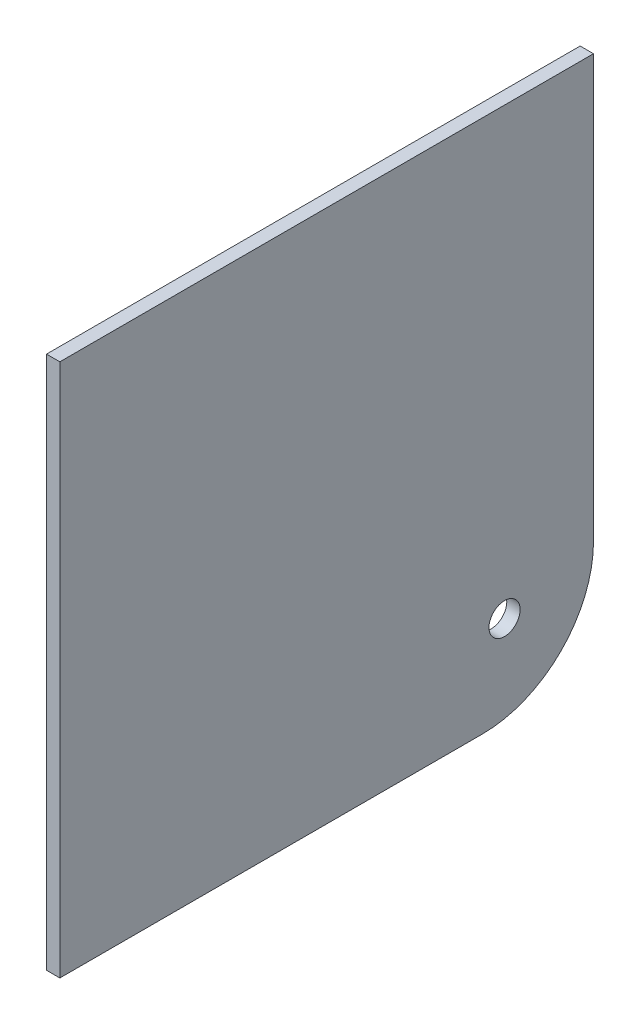
ISO-10303-21;
HEADER;
FILE_DESCRIPTION(('STEP AP214'),'2;1');
FILE_NAME('part.step','',(''),(''),'','','');
FILE_SCHEMA(('AUTOMOTIVE_DESIGN { 1 0 10303 214 1 1 1 1 }'));
ENDSEC;
DATA;
#1=APPLICATION_CONTEXT('core data for automotive mechanical design processes');
#2=APPLICATION_PROTOCOL_DEFINITION('international standard','automotive_design',2000,#1);
#3=PRODUCT_CONTEXT('',#1,'mechanical');
#4=PRODUCT('Part','Part','',(#3));
#5=PRODUCT_RELATED_PRODUCT_CATEGORY('part','',(#4));
#6=PRODUCT_DEFINITION_FORMATION('','',#4);
#7=PRODUCT_DEFINITION_CONTEXT('part definition',#1,'design');
#8=PRODUCT_DEFINITION('design','',#6,#7);
#9=PRODUCT_DEFINITION_SHAPE('','',#8);
#10=(LENGTH_UNIT() NAMED_UNIT(*) SI_UNIT(.MILLI.,.METRE.));
#11=(NAMED_UNIT(*) PLANE_ANGLE_UNIT() SI_UNIT($,.RADIAN.));
#12=(NAMED_UNIT(*) SI_UNIT($,.STERADIAN.) SOLID_ANGLE_UNIT());
#13=UNCERTAINTY_MEASURE_WITH_UNIT(LENGTH_MEASURE(1.E-05),#10,'distance_accuracy_value','');
#14=(GEOMETRIC_REPRESENTATION_CONTEXT(3) GLOBAL_UNCERTAINTY_ASSIGNED_CONTEXT((#13)) GLOBAL_UNIT_ASSIGNED_CONTEXT((#10,
#11,#12)) REPRESENTATION_CONTEXT('',''));
#15=CARTESIAN_POINT('',(0.,0.,0.));
#16=DIRECTION('',(0.,0.,1.));
#17=DIRECTION('',(1.,0.,0.));
#18=AXIS2_PLACEMENT_3D('',#15,#16,#17);
#19=CARTESIAN_POINT('',(3.,-35.,-35.));
#20=DIRECTION('',(-1.,0.,0.));
#21=DIRECTION('',(0.,0.,1.));
#22=AXIS2_PLACEMENT_3D('',#19,#20,#21);
#23=PLANE('',#22);
#24=DIRECTION('',(0.,0.,-1.));
#25=VECTOR('',#24,1.);
#26=CARTESIAN_POINT('',(3.,-60.,-35.));
#27=LINE('',#26,#25);
#28=CARTESIAN_POINT('',(3.,-60.,60.));
#29=VERTEX_POINT('',#28);
#30=CARTESIAN_POINT('',(3.,-60.,-35.));
#31=VERTEX_POINT('',#30);
#32=EDGE_CURVE('E118',#29,#31,#27,.T.);
#33=ORIENTED_EDGE('',*,*,#32,.T.);
#34=CARTESIAN_POINT('',(3.,-35.,-35.));
#35=DIRECTION('',(1.,0.,0.));
#36=DIRECTION('',(0.,0.,1.));
#37=AXIS2_PLACEMENT_3D('',#34,#35,#36);
#38=CIRCLE('',#37,25.);
#39=CARTESIAN_POINT('',(3.,-35.,-60.));
#40=VERTEX_POINT('',#39);
#41=EDGE_CURVE('E85',#31,#40,#38,.T.);
#42=ORIENTED_EDGE('',*,*,#41,.T.);
#43=DIRECTION('',(0.,1.,0.));
#44=VECTOR('',#43,1.);
#45=CARTESIAN_POINT('',(3.,60.,-60.));
#46=LINE('',#45,#44);
#47=CARTESIAN_POINT('',(3.,60.,-60.));
#48=VERTEX_POINT('',#47);
#49=EDGE_CURVE('E89',#40,#48,#46,.T.);
#50=ORIENTED_EDGE('',*,*,#49,.T.);
#51=DIRECTION('',(0.,0.,1.));
#52=VECTOR('',#51,1.);
#53=CARTESIAN_POINT('',(3.,60.,-60.));
#54=LINE('',#53,#52);
#55=CARTESIAN_POINT('',(3.,60.,60.));
#56=VERTEX_POINT('',#55);
#57=EDGE_CURVE('E93',#48,#56,#54,.T.);
#58=ORIENTED_EDGE('',*,*,#57,.T.);
#59=DIRECTION('',(0.,-1.,0.));
#60=VECTOR('',#59,1.);
#61=CARTESIAN_POINT('',(3.,60.,60.));
#62=LINE('',#61,#60);
#63=EDGE_CURVE('E51',#56,#29,#62,.T.);
#64=ORIENTED_EDGE('',*,*,#63,.T.);
#65=EDGE_LOOP('',(#33,#42,#50,#58,#64));
#66=FACE_BOUND('',#65,.T.);
#67=CARTESIAN_POINT('',(3.,-40.,-40.));
#68=DIRECTION('',(1.,0.,0.));
#69=DIRECTION('',(0.,0.,-1.));
#70=AXIS2_PLACEMENT_3D('',#67,#68,#69);
#71=CIRCLE('',#70,3.5);
#72=CARTESIAN_POINT('',(3.,-40.,-43.5));
#73=VERTEX_POINT('',#72);
#74=EDGE_CURVE('E113',#73,#73,#71,.T.);
#75=ORIENTED_EDGE('',*,*,#74,.F.);
#76=EDGE_LOOP('',(#75));
#77=FACE_BOUND('',#76,.T.);
#78=ADVANCED_FACE('F34',(#66,#77),#23,.F.);
#79=CARTESIAN_POINT('',(0.,-35.,-35.));
#80=DIRECTION('',(-1.,0.,0.));
#81=DIRECTION('',(0.,0.,1.));
#82=AXIS2_PLACEMENT_3D('',#79,#80,#81);
#83=PLANE('',#82);
#84=DIRECTION('',(0.,0.,-1.));
#85=VECTOR('',#84,1.);
#86=CARTESIAN_POINT('',(0.,-60.,-35.));
#87=LINE('',#86,#85);
#88=CARTESIAN_POINT('',(0.,-60.,60.));
#89=VERTEX_POINT('',#88);
#90=CARTESIAN_POINT('',(0.,-60.,-35.));
#91=VERTEX_POINT('',#90);
#92=EDGE_CURVE('E109',#89,#91,#87,.T.);
#93=ORIENTED_EDGE('',*,*,#92,.F.);
#94=DIRECTION('',(0.,-1.,0.));
#95=VECTOR('',#94,1.);
#96=CARTESIAN_POINT('',(0.,60.,60.));
#97=LINE('',#96,#95);
#98=CARTESIAN_POINT('',(0.,60.,60.));
#99=VERTEX_POINT('',#98);
#100=EDGE_CURVE('E77',#99,#89,#97,.T.);
#101=ORIENTED_EDGE('',*,*,#100,.F.);
#102=DIRECTION('',(0.,0.,1.));
#103=VECTOR('',#102,1.);
#104=CARTESIAN_POINT('',(0.,60.,-60.));
#105=LINE('',#104,#103);
#106=CARTESIAN_POINT('',(0.,60.,-60.));
#107=VERTEX_POINT('',#106);
#108=EDGE_CURVE('E71',#107,#99,#105,.T.);
#109=ORIENTED_EDGE('',*,*,#108,.F.);
#110=DIRECTION('',(0.,1.,0.));
#111=VECTOR('',#110,1.);
#112=CARTESIAN_POINT('',(0.,60.,-60.));
#113=LINE('',#112,#111);
#114=CARTESIAN_POINT('',(0.,-35.,-60.));
#115=VERTEX_POINT('',#114);
#116=EDGE_CURVE('E100',#115,#107,#113,.T.);
#117=ORIENTED_EDGE('',*,*,#116,.F.);
#118=CARTESIAN_POINT('',(0.,-35.,-35.));
#119=DIRECTION('',(1.,0.,0.));
#120=DIRECTION('',(0.,0.,1.));
#121=AXIS2_PLACEMENT_3D('',#118,#119,#120);
#122=CIRCLE('',#121,25.);
#123=EDGE_CURVE('E112',#91,#115,#122,.T.);
#124=ORIENTED_EDGE('',*,*,#123,.F.);
#125=EDGE_LOOP('',(#93,#101,#109,#117,#124));
#126=FACE_BOUND('',#125,.T.);
#127=CARTESIAN_POINT('',(0.,-40.,-40.));
#128=DIRECTION('',(1.,0.,0.));
#129=DIRECTION('',(0.,0.,-1.));
#130=AXIS2_PLACEMENT_3D('',#127,#128,#129);
#131=CIRCLE('',#130,3.5);
#132=CARTESIAN_POINT('',(0.,-40.,-43.5));
#133=VERTEX_POINT('',#132);
#134=EDGE_CURVE('E198',#133,#133,#131,.T.);
#135=ORIENTED_EDGE('',*,*,#134,.T.);
#136=EDGE_LOOP('',(#135));
#137=FACE_BOUND('',#136,.T.);
#138=ADVANCED_FACE('F122',(#126,#137),#83,.T.);
#139=CARTESIAN_POINT('',(3.,-60.,-35.));
#140=DIRECTION('',(0.,1.,0.));
#141=DIRECTION('',(0.,0.,1.));
#142=AXIS2_PLACEMENT_3D('',#139,#140,#141);
#143=PLANE('',#142);
#144=ORIENTED_EDGE('',*,*,#92,.T.);
#145=DIRECTION('',(-1.,0.,0.));
#146=VECTOR('',#145,1.);
#147=CARTESIAN_POINT('',(3.,-60.,-35.));
#148=LINE('',#147,#146);
#149=EDGE_CURVE('E11',#31,#91,#148,.T.);
#150=ORIENTED_EDGE('',*,*,#149,.F.);
#151=ORIENTED_EDGE('',*,*,#32,.F.);
#152=DIRECTION('',(-1.,0.,0.));
#153=VECTOR('',#152,1.);
#154=CARTESIAN_POINT('',(3.,-60.,60.));
#155=LINE('',#154,#153);
#156=EDGE_CURVE('E105',#29,#89,#155,.T.);
#157=ORIENTED_EDGE('',*,*,#156,.T.);
#158=EDGE_LOOP('',(#144,#150,#151,#157));
#159=FACE_BOUND('',#158,.T.);
#160=ADVANCED_FACE('F36',(#159),#143,.F.);
#161=CARTESIAN_POINT('',(3.,-35.,-35.));
#162=DIRECTION('',(-1.,0.,0.));
#163=DIRECTION('',(0.,0.,1.));
#164=AXIS2_PLACEMENT_3D('',#161,#162,#163);
#165=CYLINDRICAL_SURFACE('',#164,25.);
#166=ORIENTED_EDGE('',*,*,#123,.T.);
#167=DIRECTION('',(-1.,0.,0.));
#168=VECTOR('',#167,1.);
#169=CARTESIAN_POINT('',(3.,-35.,-60.));
#170=LINE('',#169,#168);
#171=EDGE_CURVE('E43',#40,#115,#170,.T.);
#172=ORIENTED_EDGE('',*,*,#171,.F.);
#173=ORIENTED_EDGE('',*,*,#41,.F.);
#174=ORIENTED_EDGE('',*,*,#149,.T.);
#175=EDGE_LOOP('',(#166,#172,#173,#174));
#176=FACE_BOUND('',#175,.T.);
#177=ADVANCED_FACE('F147',(#176),#165,.T.);
#178=CARTESIAN_POINT('',(3.,60.,-60.));
#179=DIRECTION('',(0.,0.,1.));
#180=DIRECTION('',(1.,0.,0.));
#181=AXIS2_PLACEMENT_3D('',#178,#179,#180);
#182=PLANE('',#181);
#183=ORIENTED_EDGE('',*,*,#116,.T.);
#184=DIRECTION('',(-1.,0.,0.));
#185=VECTOR('',#184,1.);
#186=CARTESIAN_POINT('',(3.,60.,-60.));
#187=LINE('',#186,#185);
#188=EDGE_CURVE('E97',#48,#107,#187,.T.);
#189=ORIENTED_EDGE('',*,*,#188,.F.);
#190=ORIENTED_EDGE('',*,*,#49,.F.);
#191=ORIENTED_EDGE('',*,*,#171,.T.);
#192=EDGE_LOOP('',(#183,#189,#190,#191));
#193=FACE_BOUND('',#192,.T.);
#194=ADVANCED_FACE('F98',(#193),#182,.F.);
#195=CARTESIAN_POINT('',(3.,60.,-60.));
#196=DIRECTION('',(0.,-1.,0.));
#197=DIRECTION('',(0.,0.,-1.));
#198=AXIS2_PLACEMENT_3D('',#195,#196,#197);
#199=PLANE('',#198);
#200=ORIENTED_EDGE('',*,*,#108,.T.);
#201=DIRECTION('',(-1.,0.,0.));
#202=VECTOR('',#201,1.);
#203=CARTESIAN_POINT('',(3.,60.,60.));
#204=LINE('',#203,#202);
#205=EDGE_CURVE('E101',#56,#99,#204,.T.);
#206=ORIENTED_EDGE('',*,*,#205,.F.);
#207=ORIENTED_EDGE('',*,*,#57,.F.);
#208=ORIENTED_EDGE('',*,*,#188,.T.);
#209=EDGE_LOOP('',(#200,#206,#207,#208));
#210=FACE_BOUND('',#209,.T.);
#211=ADVANCED_FACE('F103',(#210),#199,.F.);
#212=CARTESIAN_POINT('',(3.,60.,60.));
#213=DIRECTION('',(0.,0.,-1.));
#214=DIRECTION('',(-1.,0.,0.));
#215=AXIS2_PLACEMENT_3D('',#212,#213,#214);
#216=PLANE('',#215);
#217=ORIENTED_EDGE('',*,*,#100,.T.);
#218=ORIENTED_EDGE('',*,*,#156,.F.);
#219=ORIENTED_EDGE('',*,*,#63,.F.);
#220=ORIENTED_EDGE('',*,*,#205,.T.);
#221=EDGE_LOOP('',(#217,#218,#219,#220));
#222=FACE_BOUND('',#221,.T.);
#223=ADVANCED_FACE('F127',(#222),#216,.F.);
#224=CARTESIAN_POINT('',(3.,-40.,-40.));
#225=DIRECTION('',(-1.,0.,0.));
#226=DIRECTION('',(0.,0.,1.));
#227=AXIS2_PLACEMENT_3D('',#224,#225,#226);
#228=CYLINDRICAL_SURFACE('',#227,3.5);
#229=ORIENTED_EDGE('',*,*,#74,.T.);
#230=EDGE_LOOP('',(#229));
#231=FACE_BOUND('',#230,.T.);
#232=ORIENTED_EDGE('',*,*,#134,.F.);
#233=EDGE_LOOP('',(#232));
#234=FACE_BOUND('',#233,.T.);
#235=ADVANCED_FACE('F129',(#231,#234),#228,.F.);
#236=CLOSED_SHELL('',(#78,#138,#160,#177,#194,#211,#223,#235));
#237=MANIFOLD_SOLID_BREP('B2',#236);
#238=ADVANCED_BREP_SHAPE_REPRESENTATION('',(#18,#237),#14);
#239=SHAPE_DEFINITION_REPRESENTATION(#9,#238);
ENDSEC;
END-ISO-10303-21;
